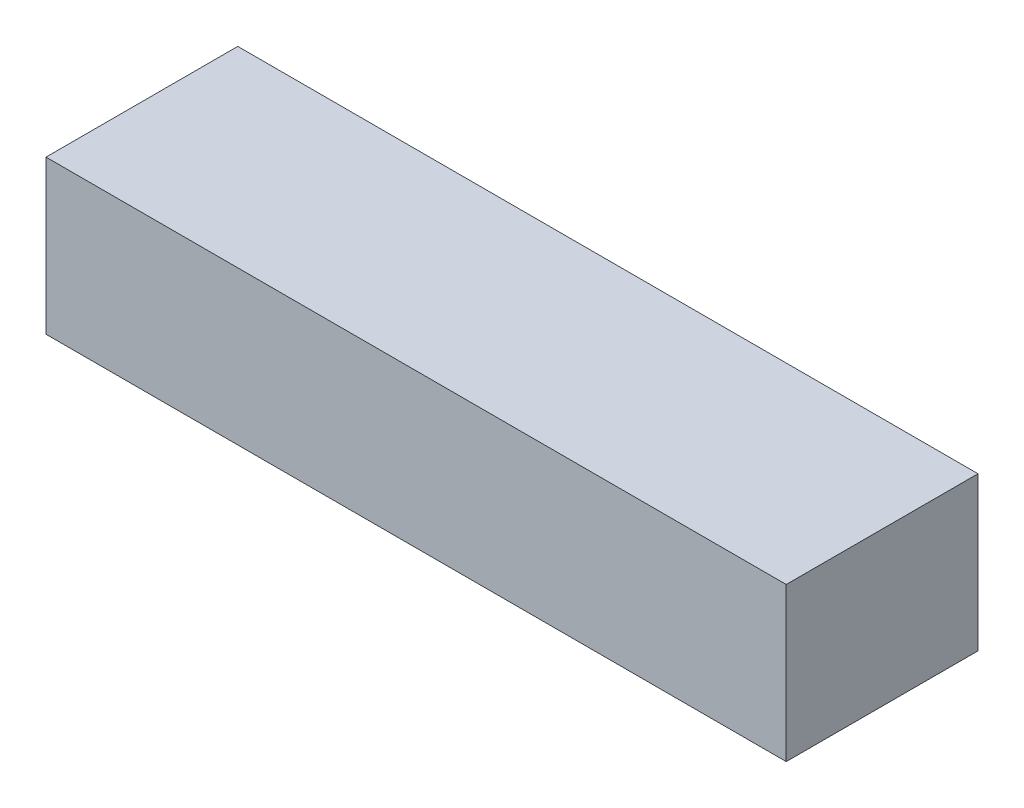
ISO-10303-21;
HEADER;
FILE_DESCRIPTION(('STEP AP214'),'2;1');
FILE_NAME('part.step','',(''),(''),'','','');
FILE_SCHEMA(('AUTOMOTIVE_DESIGN { 1 0 10303 214 1 1 1 1 }'));
ENDSEC;
DATA;
#1=APPLICATION_CONTEXT('core data for automotive mechanical design processes');
#2=APPLICATION_PROTOCOL_DEFINITION('international standard','automotive_design',2000,#1);
#3=PRODUCT_CONTEXT('',#1,'mechanical');
#4=PRODUCT('Part','Part','',(#3));
#5=PRODUCT_RELATED_PRODUCT_CATEGORY('part','',(#4));
#6=PRODUCT_DEFINITION_FORMATION('','',#4);
#7=PRODUCT_DEFINITION_CONTEXT('part definition',#1,'design');
#8=PRODUCT_DEFINITION('design','',#6,#7);
#9=PRODUCT_DEFINITION_SHAPE('','',#8);
#10=(LENGTH_UNIT() NAMED_UNIT(*) SI_UNIT(.MILLI.,.METRE.));
#11=(NAMED_UNIT(*) PLANE_ANGLE_UNIT() SI_UNIT($,.RADIAN.));
#12=(NAMED_UNIT(*) SI_UNIT($,.STERADIAN.) SOLID_ANGLE_UNIT());
#13=UNCERTAINTY_MEASURE_WITH_UNIT(LENGTH_MEASURE(1.E-05),#10,'distance_accuracy_value','');
#14=(GEOMETRIC_REPRESENTATION_CONTEXT(3) GLOBAL_UNCERTAINTY_ASSIGNED_CONTEXT((#13)) GLOBAL_UNIT_ASSIGNED_CONTEXT((#10,
#11,#12)) REPRESENTATION_CONTEXT('',''));
#15=CARTESIAN_POINT('',(0.,0.,0.));
#16=DIRECTION('',(0.,0.,1.));
#17=DIRECTION('',(1.,0.,0.));
#18=AXIS2_PLACEMENT_3D('',#15,#16,#17);
#19=CARTESIAN_POINT('',(0.,0.,0.));
#20=DIRECTION('',(0.,-1.,0.));
#21=DIRECTION('',(0.,0.,-1.));
#22=AXIS2_PLACEMENT_3D('',#19,#20,#21);
#23=PLANE('',#22);
#24=DIRECTION('',(0.,0.,-1.));
#25=VECTOR('',#24,1.);
#26=CARTESIAN_POINT('',(38.6,0.,10.));
#27=LINE('',#26,#25);
#28=CARTESIAN_POINT('',(38.6,0.,10.));
#29=VERTEX_POINT('',#28);
#30=CARTESIAN_POINT('',(38.6,0.,-10.));
#31=VERTEX_POINT('',#30);
#32=EDGE_CURVE('E331',#29,#31,#27,.T.);
#33=ORIENTED_EDGE('',*,*,#32,.F.);
#34=DIRECTION('',(1.,0.,0.));
#35=VECTOR('',#34,1.);
#36=CARTESIAN_POINT('',(-38.6,0.,10.));
#37=LINE('',#36,#35);
#38=CARTESIAN_POINT('',(-38.6,0.,10.));
#39=VERTEX_POINT('',#38);
#40=EDGE_CURVE('E337',#39,#29,#37,.T.);
#41=ORIENTED_EDGE('',*,*,#40,.F.);
#42=DIRECTION('',(0.,0.,1.));
#43=VECTOR('',#42,1.);
#44=CARTESIAN_POINT('',(-38.6,0.,10.));
#45=LINE('',#44,#43);
#46=CARTESIAN_POINT('',(-38.6,0.,-10.));
#47=VERTEX_POINT('',#46);
#48=EDGE_CURVE('E181',#47,#39,#45,.T.);
#49=ORIENTED_EDGE('',*,*,#48,.F.);
#50=DIRECTION('',(-1.,0.,0.));
#51=VECTOR('',#50,1.);
#52=CARTESIAN_POINT('',(-38.6,0.,-10.));
#53=LINE('',#52,#51);
#54=EDGE_CURVE('E334',#31,#47,#53,.T.);
#55=ORIENTED_EDGE('',*,*,#54,.F.);
#56=EDGE_LOOP('',(#33,#41,#49,#55));
#57=FACE_BOUND('',#56,.T.);
#58=DIRECTION('',(1.,0.,0.));
#59=VECTOR('',#58,1.);
#60=CARTESIAN_POINT('',(-36.6,0.,8.));
#61=LINE('',#60,#59);
#62=CARTESIAN_POINT('',(-36.6,0.,8.));
#63=VERTEX_POINT('',#62);
#64=CARTESIAN_POINT('',(-20.6,0.,8.));
#65=VERTEX_POINT('',#64);
#66=EDGE_CURVE('E302',#63,#65,#61,.T.);
#67=ORIENTED_EDGE('',*,*,#66,.T.);
#68=DIRECTION('',(0.,0.,-1.));
#69=VECTOR('',#68,1.);
#70=CARTESIAN_POINT('',(-20.6,0.,-8.));
#71=LINE('',#70,#69);
#72=CARTESIAN_POINT('',(-20.6,0.,-8.));
#73=VERTEX_POINT('',#72);
#74=EDGE_CURVE('E297',#65,#73,#71,.T.);
#75=ORIENTED_EDGE('',*,*,#74,.T.);
#76=DIRECTION('',(-1.,0.,0.));
#77=VECTOR('',#76,1.);
#78=CARTESIAN_POINT('',(-36.6,0.,-8.));
#79=LINE('',#78,#77);
#80=CARTESIAN_POINT('',(-36.6,0.,-8.));
#81=VERTEX_POINT('',#80);
#82=EDGE_CURVE('E314',#73,#81,#79,.T.);
#83=ORIENTED_EDGE('',*,*,#82,.T.);
#84=DIRECTION('',(0.,0.,1.));
#85=VECTOR('',#84,1.);
#86=CARTESIAN_POINT('',(-36.6,0.,-8.));
#87=LINE('',#86,#85);
#88=EDGE_CURVE('E317',#81,#63,#87,.T.);
#89=ORIENTED_EDGE('',*,*,#88,.T.);
#90=EDGE_LOOP('',(#67,#75,#83,#89));
#91=FACE_BOUND('',#90,.T.);
#92=DIRECTION('',(1.,0.,0.));
#93=VECTOR('',#92,1.);
#94=CARTESIAN_POINT('',(-17.6,0.,8.));
#95=LINE('',#94,#93);
#96=CARTESIAN_POINT('',(-17.6,0.,8.));
#97=VERTEX_POINT('',#96);
#98=CARTESIAN_POINT('',(-1.6,0.,8.));
#99=VERTEX_POINT('',#98);
#100=EDGE_CURVE('E268',#97,#99,#95,.T.);
#101=ORIENTED_EDGE('',*,*,#100,.T.);
#102=DIRECTION('',(0.,0.,-1.));
#103=VECTOR('',#102,1.);
#104=CARTESIAN_POINT('',(-1.6,0.,-8.));
#105=LINE('',#104,#103);
#106=CARTESIAN_POINT('',(-1.6,0.,-8.));
#107=VERTEX_POINT('',#106);
#108=EDGE_CURVE('E263',#99,#107,#105,.T.);
#109=ORIENTED_EDGE('',*,*,#108,.T.);
#110=DIRECTION('',(-1.,0.,0.));
#111=VECTOR('',#110,1.);
#112=CARTESIAN_POINT('',(-17.6,0.,-8.));
#113=LINE('',#112,#111);
#114=CARTESIAN_POINT('',(-17.6,0.,-8.));
#115=VERTEX_POINT('',#114);
#116=EDGE_CURVE('E280',#107,#115,#113,.T.);
#117=ORIENTED_EDGE('',*,*,#116,.T.);
#118=DIRECTION('',(0.,0.,1.));
#119=VECTOR('',#118,1.);
#120=CARTESIAN_POINT('',(-17.6,0.,-8.));
#121=LINE('',#120,#119);
#122=EDGE_CURVE('E283',#115,#97,#121,.T.);
#123=ORIENTED_EDGE('',*,*,#122,.T.);
#124=EDGE_LOOP('',(#101,#109,#117,#123));
#125=FACE_BOUND('',#124,.T.);
#126=DIRECTION('',(1.,0.,0.));
#127=VECTOR('',#126,1.);
#128=CARTESIAN_POINT('',(1.4,0.,8.));
#129=LINE('',#128,#127);
#130=CARTESIAN_POINT('',(1.4,0.,8.));
#131=VERTEX_POINT('',#130);
#132=CARTESIAN_POINT('',(17.4,0.,8.));
#133=VERTEX_POINT('',#132);
#134=EDGE_CURVE('E237',#131,#133,#129,.T.);
#135=ORIENTED_EDGE('',*,*,#134,.T.);
#136=DIRECTION('',(0.,0.,-1.));
#137=VECTOR('',#136,1.);
#138=CARTESIAN_POINT('',(17.4,0.,-8.));
#139=LINE('',#138,#137);
#140=CARTESIAN_POINT('',(17.4,0.,-8.));
#141=VERTEX_POINT('',#140);
#142=EDGE_CURVE('E56',#133,#141,#139,.T.);
#143=ORIENTED_EDGE('',*,*,#142,.T.);
#144=DIRECTION('',(-1.,0.,0.));
#145=VECTOR('',#144,1.);
#146=CARTESIAN_POINT('',(1.4,0.,-8.));
#147=LINE('',#146,#145);
#148=CARTESIAN_POINT('',(1.4,0.,-8.));
#149=VERTEX_POINT('',#148);
#150=EDGE_CURVE('E248',#141,#149,#147,.T.);
#151=ORIENTED_EDGE('',*,*,#150,.T.);
#152=DIRECTION('',(0.,0.,1.));
#153=VECTOR('',#152,1.);
#154=CARTESIAN_POINT('',(1.4,0.,-8.));
#155=LINE('',#154,#153);
#156=EDGE_CURVE('E251',#149,#131,#155,.T.);
#157=ORIENTED_EDGE('',*,*,#156,.T.);
#158=EDGE_LOOP('',(#135,#143,#151,#157));
#159=FACE_BOUND('',#158,.T.);
#160=DIRECTION('',(1.,0.,0.));
#161=VECTOR('',#160,1.);
#162=CARTESIAN_POINT('',(20.4,0.,8.));
#163=LINE('',#162,#161);
#164=CARTESIAN_POINT('',(20.4,0.,8.));
#165=VERTEX_POINT('',#164);
#166=CARTESIAN_POINT('',(36.4,0.,8.));
#167=VERTEX_POINT('',#166);
#168=EDGE_CURVE('E207',#165,#167,#163,.T.);
#169=ORIENTED_EDGE('',*,*,#168,.T.);
#170=DIRECTION('',(0.,0.,-1.));
#171=VECTOR('',#170,1.);
#172=CARTESIAN_POINT('',(36.4,0.,-8.));
#173=LINE('',#172,#171);
#174=CARTESIAN_POINT('',(36.4,0.,-8.));
#175=VERTEX_POINT('',#174);
#176=EDGE_CURVE('E48',#167,#175,#173,.T.);
#177=ORIENTED_EDGE('',*,*,#176,.T.);
#178=DIRECTION('',(-1.,0.,0.));
#179=VECTOR('',#178,1.);
#180=CARTESIAN_POINT('',(20.4,0.,-8.));
#181=LINE('',#180,#179);
#182=CARTESIAN_POINT('',(20.4,0.,-8.));
#183=VERTEX_POINT('',#182);
#184=EDGE_CURVE('E218',#175,#183,#181,.T.);
#185=ORIENTED_EDGE('',*,*,#184,.T.);
#186=DIRECTION('',(0.,0.,1.));
#187=VECTOR('',#186,1.);
#188=CARTESIAN_POINT('',(20.4,0.,-8.));
#189=LINE('',#188,#187);
#190=EDGE_CURVE('E221',#183,#165,#189,.T.);
#191=ORIENTED_EDGE('',*,*,#190,.T.);
#192=EDGE_LOOP('',(#169,#177,#185,#191));
#193=FACE_BOUND('',#192,.T.);
#194=ADVANCED_FACE('F33',(#57,#91,#125,#159,#193),#23,.T.);
#195=CARTESIAN_POINT('',(38.6,14.,10.));
#196=DIRECTION('',(-1.,0.,0.));
#197=DIRECTION('',(0.,0.,1.));
#198=AXIS2_PLACEMENT_3D('',#195,#196,#197);
#199=PLANE('',#198);
#200=ORIENTED_EDGE('',*,*,#32,.T.);
#201=DIRECTION('',(0.,-1.,0.));
#202=VECTOR('',#201,1.);
#203=CARTESIAN_POINT('',(38.6,14.,-10.));
#204=LINE('',#203,#202);
#205=CARTESIAN_POINT('',(38.6,16.,-10.));
#206=VERTEX_POINT('',#205);
#207=EDGE_CURVE('E11',#206,#31,#204,.T.);
#208=ORIENTED_EDGE('',*,*,#207,.F.);
#209=DIRECTION('',(0.,0.,-1.));
#210=VECTOR('',#209,1.);
#211=CARTESIAN_POINT('',(38.6,16.,-10.));
#212=LINE('',#211,#210);
#213=CARTESIAN_POINT('',(38.6,16.,10.));
#214=VERTEX_POINT('',#213);
#215=EDGE_CURVE('E193',#214,#206,#212,.T.);
#216=ORIENTED_EDGE('',*,*,#215,.F.);
#217=DIRECTION('',(0.,-1.,0.));
#218=VECTOR('',#217,1.);
#219=CARTESIAN_POINT('',(38.6,14.,10.));
#220=LINE('',#219,#218);
#221=EDGE_CURVE('E184',#214,#29,#220,.T.);
#222=ORIENTED_EDGE('',*,*,#221,.T.);
#223=EDGE_LOOP('',(#200,#208,#216,#222));
#224=FACE_BOUND('',#223,.T.);
#225=ADVANCED_FACE('F35',(#224),#199,.F.);
#226=CARTESIAN_POINT('',(-38.6,14.,-10.));
#227=DIRECTION('',(0.,0.,1.));
#228=DIRECTION('',(1.,0.,0.));
#229=AXIS2_PLACEMENT_3D('',#226,#227,#228);
#230=PLANE('',#229);
#231=ORIENTED_EDGE('',*,*,#54,.T.);
#232=DIRECTION('',(0.,-1.,0.));
#233=VECTOR('',#232,1.);
#234=CARTESIAN_POINT('',(-38.6,14.,-10.));
#235=LINE('',#234,#233);
#236=CARTESIAN_POINT('',(-38.6,16.,-10.));
#237=VERTEX_POINT('',#236);
#238=EDGE_CURVE('E41',#237,#47,#235,.T.);
#239=ORIENTED_EDGE('',*,*,#238,.F.);
#240=DIRECTION('',(-1.,0.,0.));
#241=VECTOR('',#240,1.);
#242=CARTESIAN_POINT('',(-38.6,16.,-10.));
#243=LINE('',#242,#241);
#244=EDGE_CURVE('E198',#206,#237,#243,.T.);
#245=ORIENTED_EDGE('',*,*,#244,.F.);
#246=ORIENTED_EDGE('',*,*,#207,.T.);
#247=EDGE_LOOP('',(#231,#239,#245,#246));
#248=FACE_BOUND('',#247,.T.);
#249=ADVANCED_FACE('F344',(#248),#230,.F.);
#250=CARTESIAN_POINT('',(-38.6,14.,10.));
#251=DIRECTION('',(1.,0.,0.));
#252=DIRECTION('',(0.,0.,-1.));
#253=AXIS2_PLACEMENT_3D('',#250,#251,#252);
#254=PLANE('',#253);
#255=ORIENTED_EDGE('',*,*,#48,.T.);
#256=DIRECTION('',(0.,-1.,0.));
#257=VECTOR('',#256,1.);
#258=CARTESIAN_POINT('',(-38.6,14.,10.));
#259=LINE('',#258,#257);
#260=CARTESIAN_POINT('',(-38.6,16.,10.));
#261=VERTEX_POINT('',#260);
#262=EDGE_CURVE('E174',#261,#39,#259,.T.);
#263=ORIENTED_EDGE('',*,*,#262,.F.);
#264=DIRECTION('',(0.,0.,1.));
#265=VECTOR('',#264,1.);
#266=CARTESIAN_POINT('',(-38.6,16.,-10.));
#267=LINE('',#266,#265);
#268=EDGE_CURVE('E179',#237,#261,#267,.T.);
#269=ORIENTED_EDGE('',*,*,#268,.F.);
#270=ORIENTED_EDGE('',*,*,#238,.T.);
#271=EDGE_LOOP('',(#255,#263,#269,#270));
#272=FACE_BOUND('',#271,.T.);
#273=ADVANCED_FACE('F176',(#272),#254,.F.);
#274=CARTESIAN_POINT('',(-38.6,14.,10.));
#275=DIRECTION('',(0.,0.,-1.));
#276=DIRECTION('',(-1.,0.,0.));
#277=AXIS2_PLACEMENT_3D('',#274,#275,#276);
#278=PLANE('',#277);
#279=ORIENTED_EDGE('',*,*,#40,.T.);
#280=ORIENTED_EDGE('',*,*,#221,.F.);
#281=DIRECTION('',(1.,0.,0.));
#282=VECTOR('',#281,1.);
#283=CARTESIAN_POINT('',(-38.6,16.,10.));
#284=LINE('',#283,#282);
#285=EDGE_CURVE('E187',#261,#214,#284,.T.);
#286=ORIENTED_EDGE('',*,*,#285,.F.);
#287=ORIENTED_EDGE('',*,*,#262,.T.);
#288=EDGE_LOOP('',(#279,#280,#286,#287));
#289=FACE_BOUND('',#288,.T.);
#290=ADVANCED_FACE('F188',(#289),#278,.F.);
#291=CARTESIAN_POINT('',(-20.6,14.,-8.));
#292=DIRECTION('',(-1.,0.,0.));
#293=DIRECTION('',(0.,0.,1.));
#294=AXIS2_PLACEMENT_3D('',#291,#292,#293);
#295=PLANE('',#294);
#296=ORIENTED_EDGE('',*,*,#74,.F.);
#297=DIRECTION('',(0.,-1.,0.));
#298=VECTOR('',#297,1.);
#299=CARTESIAN_POINT('',(-20.6,14.,8.));
#300=LINE('',#299,#298);
#301=CARTESIAN_POINT('',(-20.6,14.,8.));
#302=VERTEX_POINT('',#301);
#303=EDGE_CURVE('E311',#302,#65,#300,.T.);
#304=ORIENTED_EDGE('',*,*,#303,.F.);
#305=DIRECTION('',(0.,0.,-1.));
#306=VECTOR('',#305,1.);
#307=CARTESIAN_POINT('',(-20.6,14.,-8.));
#308=LINE('',#307,#306);
#309=CARTESIAN_POINT('',(-20.6,14.,-8.));
#310=VERTEX_POINT('',#309);
#311=EDGE_CURVE('E298',#302,#310,#308,.T.);
#312=ORIENTED_EDGE('',*,*,#311,.T.);
#313=DIRECTION('',(0.,-1.,0.));
#314=VECTOR('',#313,1.);
#315=CARTESIAN_POINT('',(-20.6,14.,-8.));
#316=LINE('',#315,#314);
#317=EDGE_CURVE('E328',#310,#73,#316,.T.);
#318=ORIENTED_EDGE('',*,*,#317,.T.);
#319=EDGE_LOOP('',(#296,#304,#312,#318));
#320=FACE_BOUND('',#319,.T.);
#321=ADVANCED_FACE('F357',(#320),#295,.T.);
#322=CARTESIAN_POINT('',(-36.6,14.,-8.));
#323=DIRECTION('',(0.,0.,1.));
#324=DIRECTION('',(1.,0.,0.));
#325=AXIS2_PLACEMENT_3D('',#322,#323,#324);
#326=PLANE('',#325);
#327=ORIENTED_EDGE('',*,*,#82,.F.);
#328=ORIENTED_EDGE('',*,*,#317,.F.);
#329=DIRECTION('',(-1.,0.,0.));
#330=VECTOR('',#329,1.);
#331=CARTESIAN_POINT('',(-36.6,14.,-8.));
#332=LINE('',#331,#330);
#333=CARTESIAN_POINT('',(-36.6,14.,-8.));
#334=VERTEX_POINT('',#333);
#335=EDGE_CURVE('E301',#310,#334,#332,.T.);
#336=ORIENTED_EDGE('',*,*,#335,.T.);
#337=DIRECTION('',(0.,-1.,0.));
#338=VECTOR('',#337,1.);
#339=CARTESIAN_POINT('',(-36.6,14.,-8.));
#340=LINE('',#339,#338);
#341=EDGE_CURVE('E326',#334,#81,#340,.T.);
#342=ORIENTED_EDGE('',*,*,#341,.T.);
#343=EDGE_LOOP('',(#327,#328,#336,#342));
#344=FACE_BOUND('',#343,.T.);
#345=ADVANCED_FACE('F363',(#344),#326,.T.);
#346=CARTESIAN_POINT('',(-36.6,14.,-8.));
#347=DIRECTION('',(1.,0.,0.));
#348=DIRECTION('',(0.,0.,-1.));
#349=AXIS2_PLACEMENT_3D('',#346,#347,#348);
#350=PLANE('',#349);
#351=ORIENTED_EDGE('',*,*,#88,.F.);
#352=ORIENTED_EDGE('',*,*,#341,.F.);
#353=DIRECTION('',(0.,0.,1.));
#354=VECTOR('',#353,1.);
#355=CARTESIAN_POINT('',(-36.6,14.,-8.));
#356=LINE('',#355,#354);
#357=CARTESIAN_POINT('',(-36.6,14.,8.));
#358=VERTEX_POINT('',#357);
#359=EDGE_CURVE('E305',#334,#358,#356,.T.);
#360=ORIENTED_EDGE('',*,*,#359,.T.);
#361=DIRECTION('',(0.,-1.,0.));
#362=VECTOR('',#361,1.);
#363=CARTESIAN_POINT('',(-36.6,14.,8.));
#364=LINE('',#363,#362);
#365=EDGE_CURVE('E324',#358,#63,#364,.T.);
#366=ORIENTED_EDGE('',*,*,#365,.T.);
#367=EDGE_LOOP('',(#351,#352,#360,#366));
#368=FACE_BOUND('',#367,.T.);
#369=ADVANCED_FACE('F368',(#368),#350,.T.);
#370=CARTESIAN_POINT('',(-36.6,14.,8.));
#371=DIRECTION('',(0.,0.,-1.));
#372=DIRECTION('',(-1.,0.,0.));
#373=AXIS2_PLACEMENT_3D('',#370,#371,#372);
#374=PLANE('',#373);
#375=ORIENTED_EDGE('',*,*,#66,.F.);
#376=ORIENTED_EDGE('',*,*,#365,.F.);
#377=DIRECTION('',(1.,0.,0.));
#378=VECTOR('',#377,1.);
#379=CARTESIAN_POINT('',(-36.6,14.,8.));
#380=LINE('',#379,#378);
#381=EDGE_CURVE('E308',#358,#302,#380,.T.);
#382=ORIENTED_EDGE('',*,*,#381,.T.);
#383=ORIENTED_EDGE('',*,*,#303,.T.);
#384=EDGE_LOOP('',(#375,#376,#382,#383));
#385=FACE_BOUND('',#384,.T.);
#386=ADVANCED_FACE('F374',(#385),#374,.T.);
#387=CARTESIAN_POINT('',(-1.6,14.,-8.));
#388=DIRECTION('',(-1.,0.,0.));
#389=DIRECTION('',(0.,0.,1.));
#390=AXIS2_PLACEMENT_3D('',#387,#388,#389);
#391=PLANE('',#390);
#392=ORIENTED_EDGE('',*,*,#108,.F.);
#393=DIRECTION('',(0.,-1.,0.));
#394=VECTOR('',#393,1.);
#395=CARTESIAN_POINT('',(-1.6,14.,8.));
#396=LINE('',#395,#394);
#397=CARTESIAN_POINT('',(-1.6,14.,8.));
#398=VERTEX_POINT('',#397);
#399=EDGE_CURVE('E277',#398,#99,#396,.T.);
#400=ORIENTED_EDGE('',*,*,#399,.F.);
#401=DIRECTION('',(0.,0.,-1.));
#402=VECTOR('',#401,1.);
#403=CARTESIAN_POINT('',(-1.6,14.,-8.));
#404=LINE('',#403,#402);
#405=CARTESIAN_POINT('',(-1.6,14.,-8.));
#406=VERTEX_POINT('',#405);
#407=EDGE_CURVE('E264',#398,#406,#404,.T.);
#408=ORIENTED_EDGE('',*,*,#407,.T.);
#409=DIRECTION('',(0.,-1.,0.));
#410=VECTOR('',#409,1.);
#411=CARTESIAN_POINT('',(-1.6,14.,-8.));
#412=LINE('',#411,#410);
#413=EDGE_CURVE('E294',#406,#107,#412,.T.);
#414=ORIENTED_EDGE('',*,*,#413,.T.);
#415=EDGE_LOOP('',(#392,#400,#408,#414));
#416=FACE_BOUND('',#415,.T.);
#417=ADVANCED_FACE('F444',(#416),#391,.T.);
#418=CARTESIAN_POINT('',(-17.6,14.,-8.));
#419=DIRECTION('',(0.,0.,1.));
#420=DIRECTION('',(1.,0.,0.));
#421=AXIS2_PLACEMENT_3D('',#418,#419,#420);
#422=PLANE('',#421);
#423=ORIENTED_EDGE('',*,*,#116,.F.);
#424=ORIENTED_EDGE('',*,*,#413,.F.);
#425=DIRECTION('',(-1.,0.,0.));
#426=VECTOR('',#425,1.);
#427=CARTESIAN_POINT('',(-17.6,14.,-8.));
#428=LINE('',#427,#426);
#429=CARTESIAN_POINT('',(-17.6,14.,-8.));
#430=VERTEX_POINT('',#429);
#431=EDGE_CURVE('E267',#406,#430,#428,.T.);
#432=ORIENTED_EDGE('',*,*,#431,.T.);
#433=DIRECTION('',(0.,-1.,0.));
#434=VECTOR('',#433,1.);
#435=CARTESIAN_POINT('',(-17.6,14.,-8.));
#436=LINE('',#435,#434);
#437=EDGE_CURVE('E292',#430,#115,#436,.T.);
#438=ORIENTED_EDGE('',*,*,#437,.T.);
#439=EDGE_LOOP('',(#423,#424,#432,#438));
#440=FACE_BOUND('',#439,.T.);
#441=ADVANCED_FACE('F440',(#440),#422,.T.);
#442=CARTESIAN_POINT('',(-17.6,14.,-8.));
#443=DIRECTION('',(1.,0.,0.));
#444=DIRECTION('',(0.,0.,-1.));
#445=AXIS2_PLACEMENT_3D('',#442,#443,#444);
#446=PLANE('',#445);
#447=ORIENTED_EDGE('',*,*,#122,.F.);
#448=ORIENTED_EDGE('',*,*,#437,.F.);
#449=DIRECTION('',(0.,0.,1.));
#450=VECTOR('',#449,1.);
#451=CARTESIAN_POINT('',(-17.6,14.,-8.));
#452=LINE('',#451,#450);
#453=CARTESIAN_POINT('',(-17.6,14.,8.));
#454=VERTEX_POINT('',#453);
#455=EDGE_CURVE('E271',#430,#454,#452,.T.);
#456=ORIENTED_EDGE('',*,*,#455,.T.);
#457=DIRECTION('',(0.,-1.,0.));
#458=VECTOR('',#457,1.);
#459=CARTESIAN_POINT('',(-17.6,14.,8.));
#460=LINE('',#459,#458);
#461=EDGE_CURVE('E290',#454,#97,#460,.T.);
#462=ORIENTED_EDGE('',*,*,#461,.T.);
#463=EDGE_LOOP('',(#447,#448,#456,#462));
#464=FACE_BOUND('',#463,.T.);
#465=ADVANCED_FACE('F436',(#464),#446,.T.);
#466=CARTESIAN_POINT('',(-17.6,14.,8.));
#467=DIRECTION('',(0.,0.,-1.));
#468=DIRECTION('',(-1.,0.,0.));
#469=AXIS2_PLACEMENT_3D('',#466,#467,#468);
#470=PLANE('',#469);
#471=ORIENTED_EDGE('',*,*,#100,.F.);
#472=ORIENTED_EDGE('',*,*,#461,.F.);
#473=DIRECTION('',(1.,0.,0.));
#474=VECTOR('',#473,1.);
#475=CARTESIAN_POINT('',(-17.6,14.,8.));
#476=LINE('',#475,#474);
#477=EDGE_CURVE('E274',#454,#398,#476,.T.);
#478=ORIENTED_EDGE('',*,*,#477,.T.);
#479=ORIENTED_EDGE('',*,*,#399,.T.);
#480=EDGE_LOOP('',(#471,#472,#478,#479));
#481=FACE_BOUND('',#480,.T.);
#482=ADVANCED_FACE('F433',(#481),#470,.T.);
#483=CARTESIAN_POINT('',(17.4,14.,-8.));
#484=DIRECTION('',(-1.,0.,0.));
#485=DIRECTION('',(0.,0.,1.));
#486=AXIS2_PLACEMENT_3D('',#483,#484,#485);
#487=PLANE('',#486);
#488=ORIENTED_EDGE('',*,*,#142,.F.);
#489=DIRECTION('',(0.,-1.,0.));
#490=VECTOR('',#489,1.);
#491=CARTESIAN_POINT('',(17.4,14.,8.));
#492=LINE('',#491,#490);
#493=CARTESIAN_POINT('',(17.4,14.,8.));
#494=VERTEX_POINT('',#493);
#495=EDGE_CURVE('E246',#494,#133,#492,.T.);
#496=ORIENTED_EDGE('',*,*,#495,.F.);
#497=DIRECTION('',(0.,0.,-1.));
#498=VECTOR('',#497,1.);
#499=CARTESIAN_POINT('',(17.4,14.,-8.));
#500=LINE('',#499,#498);
#501=CARTESIAN_POINT('',(17.4,14.,-8.));
#502=VERTEX_POINT('',#501);
#503=EDGE_CURVE('E233',#494,#502,#500,.T.);
#504=ORIENTED_EDGE('',*,*,#503,.T.);
#505=DIRECTION('',(0.,-1.,0.));
#506=VECTOR('',#505,1.);
#507=CARTESIAN_POINT('',(17.4,14.,-8.));
#508=LINE('',#507,#506);
#509=EDGE_CURVE('E261',#502,#141,#508,.T.);
#510=ORIENTED_EDGE('',*,*,#509,.T.);
#511=EDGE_LOOP('',(#488,#496,#504,#510));
#512=FACE_BOUND('',#511,.T.);
#513=ADVANCED_FACE('F429',(#512),#487,.T.);
#514=CARTESIAN_POINT('',(1.4,14.,-8.));
#515=DIRECTION('',(0.,0.,1.));
#516=DIRECTION('',(1.,0.,0.));
#517=AXIS2_PLACEMENT_3D('',#514,#515,#516);
#518=PLANE('',#517);
#519=ORIENTED_EDGE('',*,*,#150,.F.);
#520=ORIENTED_EDGE('',*,*,#509,.F.);
#521=DIRECTION('',(-1.,0.,0.));
#522=VECTOR('',#521,1.);
#523=CARTESIAN_POINT('',(1.4,14.,-8.));
#524=LINE('',#523,#522);
#525=CARTESIAN_POINT('',(1.4,14.,-8.));
#526=VERTEX_POINT('',#525);
#527=EDGE_CURVE('E236',#502,#526,#524,.T.);
#528=ORIENTED_EDGE('',*,*,#527,.T.);
#529=DIRECTION('',(0.,-1.,0.));
#530=VECTOR('',#529,1.);
#531=CARTESIAN_POINT('',(1.4,14.,-8.));
#532=LINE('',#531,#530);
#533=EDGE_CURVE('E259',#526,#149,#532,.T.);
#534=ORIENTED_EDGE('',*,*,#533,.T.);
#535=EDGE_LOOP('',(#519,#520,#528,#534));
#536=FACE_BOUND('',#535,.T.);
#537=ADVANCED_FACE('F425',(#536),#518,.T.);
#538=CARTESIAN_POINT('',(1.4,14.,-8.));
#539=DIRECTION('',(1.,0.,0.));
#540=DIRECTION('',(0.,0.,-1.));
#541=AXIS2_PLACEMENT_3D('',#538,#539,#540);
#542=PLANE('',#541);
#543=ORIENTED_EDGE('',*,*,#156,.F.);
#544=ORIENTED_EDGE('',*,*,#533,.F.);
#545=DIRECTION('',(0.,0.,1.));
#546=VECTOR('',#545,1.);
#547=CARTESIAN_POINT('',(1.4,14.,-8.));
#548=LINE('',#547,#546);
#549=CARTESIAN_POINT('',(1.4,14.,8.));
#550=VERTEX_POINT('',#549);
#551=EDGE_CURVE('E240',#526,#550,#548,.T.);
#552=ORIENTED_EDGE('',*,*,#551,.T.);
#553=DIRECTION('',(0.,-1.,0.));
#554=VECTOR('',#553,1.);
#555=CARTESIAN_POINT('',(1.4,14.,8.));
#556=LINE('',#555,#554);
#557=EDGE_CURVE('E257',#550,#131,#556,.T.);
#558=ORIENTED_EDGE('',*,*,#557,.T.);
#559=EDGE_LOOP('',(#543,#544,#552,#558));
#560=FACE_BOUND('',#559,.T.);
#561=ADVANCED_FACE('F418',(#560),#542,.T.);
#562=CARTESIAN_POINT('',(1.4,14.,8.));
#563=DIRECTION('',(0.,0.,-1.));
#564=DIRECTION('',(-1.,0.,0.));
#565=AXIS2_PLACEMENT_3D('',#562,#563,#564);
#566=PLANE('',#565);
#567=ORIENTED_EDGE('',*,*,#134,.F.);
#568=ORIENTED_EDGE('',*,*,#557,.F.);
#569=DIRECTION('',(1.,0.,0.));
#570=VECTOR('',#569,1.);
#571=CARTESIAN_POINT('',(1.4,14.,8.));
#572=LINE('',#571,#570);
#573=EDGE_CURVE('E243',#550,#494,#572,.T.);
#574=ORIENTED_EDGE('',*,*,#573,.T.);
#575=ORIENTED_EDGE('',*,*,#495,.T.);
#576=EDGE_LOOP('',(#567,#568,#574,#575));
#577=FACE_BOUND('',#576,.T.);
#578=ADVANCED_FACE('F410',(#577),#566,.T.);
#579=CARTESIAN_POINT('',(36.4,14.,-8.));
#580=DIRECTION('',(-1.,0.,0.));
#581=DIRECTION('',(0.,0.,1.));
#582=AXIS2_PLACEMENT_3D('',#579,#580,#581);
#583=PLANE('',#582);
#584=ORIENTED_EDGE('',*,*,#176,.F.);
#585=DIRECTION('',(0.,-1.,0.));
#586=VECTOR('',#585,1.);
#587=CARTESIAN_POINT('',(36.4,14.,8.));
#588=LINE('',#587,#586);
#589=CARTESIAN_POINT('',(36.4,14.,8.));
#590=VERTEX_POINT('',#589);
#591=EDGE_CURVE('E216',#590,#167,#588,.T.);
#592=ORIENTED_EDGE('',*,*,#591,.F.);
#593=DIRECTION('',(0.,0.,-1.));
#594=VECTOR('',#593,1.);
#595=CARTESIAN_POINT('',(36.4,14.,-8.));
#596=LINE('',#595,#594);
#597=CARTESIAN_POINT('',(36.4,14.,-8.));
#598=VERTEX_POINT('',#597);
#599=EDGE_CURVE('E203',#590,#598,#596,.T.);
#600=ORIENTED_EDGE('',*,*,#599,.T.);
#601=DIRECTION('',(0.,-1.,0.));
#602=VECTOR('',#601,1.);
#603=CARTESIAN_POINT('',(36.4,14.,-8.));
#604=LINE('',#603,#602);
#605=EDGE_CURVE('E231',#598,#175,#604,.T.);
#606=ORIENTED_EDGE('',*,*,#605,.T.);
#607=EDGE_LOOP('',(#584,#592,#600,#606));
#608=FACE_BOUND('',#607,.T.);
#609=ADVANCED_FACE('F407',(#608),#583,.T.);
#610=CARTESIAN_POINT('',(20.4,14.,-8.));
#611=DIRECTION('',(0.,0.,1.));
#612=DIRECTION('',(1.,0.,0.));
#613=AXIS2_PLACEMENT_3D('',#610,#611,#612);
#614=PLANE('',#613);
#615=ORIENTED_EDGE('',*,*,#184,.F.);
#616=ORIENTED_EDGE('',*,*,#605,.F.);
#617=DIRECTION('',(-1.,0.,0.));
#618=VECTOR('',#617,1.);
#619=CARTESIAN_POINT('',(20.4,14.,-8.));
#620=LINE('',#619,#618);
#621=CARTESIAN_POINT('',(20.4,14.,-8.));
#622=VERTEX_POINT('',#621);
#623=EDGE_CURVE('E206',#598,#622,#620,.T.);
#624=ORIENTED_EDGE('',*,*,#623,.T.);
#625=DIRECTION('',(0.,-1.,0.));
#626=VECTOR('',#625,1.);
#627=CARTESIAN_POINT('',(20.4,14.,-8.));
#628=LINE('',#627,#626);
#629=EDGE_CURVE('E229',#622,#183,#628,.T.);
#630=ORIENTED_EDGE('',*,*,#629,.T.);
#631=EDGE_LOOP('',(#615,#616,#624,#630));
#632=FACE_BOUND('',#631,.T.);
#633=ADVANCED_FACE('F409',(#632),#614,.T.);
#634=CARTESIAN_POINT('',(20.4,14.,-8.));
#635=DIRECTION('',(1.,0.,0.));
#636=DIRECTION('',(0.,0.,-1.));
#637=AXIS2_PLACEMENT_3D('',#634,#635,#636);
#638=PLANE('',#637);
#639=ORIENTED_EDGE('',*,*,#190,.F.);
#640=ORIENTED_EDGE('',*,*,#629,.F.);
#641=DIRECTION('',(0.,0.,1.));
#642=VECTOR('',#641,1.);
#643=CARTESIAN_POINT('',(20.4,14.,-8.));
#644=LINE('',#643,#642);
#645=CARTESIAN_POINT('',(20.4,14.,8.));
#646=VERTEX_POINT('',#645);
#647=EDGE_CURVE('E210',#622,#646,#644,.T.);
#648=ORIENTED_EDGE('',*,*,#647,.T.);
#649=DIRECTION('',(0.,-1.,0.));
#650=VECTOR('',#649,1.);
#651=CARTESIAN_POINT('',(20.4,14.,8.));
#652=LINE('',#651,#650);
#653=EDGE_CURVE('E227',#646,#165,#652,.T.);
#654=ORIENTED_EDGE('',*,*,#653,.T.);
#655=EDGE_LOOP('',(#639,#640,#648,#654));
#656=FACE_BOUND('',#655,.T.);
#657=ADVANCED_FACE('F402',(#656),#638,.T.);
#658=CARTESIAN_POINT('',(20.4,14.,8.));
#659=DIRECTION('',(0.,0.,-1.));
#660=DIRECTION('',(-1.,0.,0.));
#661=AXIS2_PLACEMENT_3D('',#658,#659,#660);
#662=PLANE('',#661);
#663=ORIENTED_EDGE('',*,*,#168,.F.);
#664=ORIENTED_EDGE('',*,*,#653,.F.);
#665=DIRECTION('',(1.,0.,0.));
#666=VECTOR('',#665,1.);
#667=CARTESIAN_POINT('',(20.4,14.,8.));
#668=LINE('',#667,#666);
#669=EDGE_CURVE('E213',#646,#590,#668,.T.);
#670=ORIENTED_EDGE('',*,*,#669,.T.);
#671=ORIENTED_EDGE('',*,*,#591,.T.);
#672=EDGE_LOOP('',(#663,#664,#670,#671));
#673=FACE_BOUND('',#672,.T.);
#674=ADVANCED_FACE('F395',(#673),#662,.T.);
#675=CARTESIAN_POINT('',(0.,14.,0.));
#676=DIRECTION('',(0.,1.,0.));
#677=DIRECTION('',(0.,0.,1.));
#678=AXIS2_PLACEMENT_3D('',#675,#676,#677);
#679=PLANE('',#678);
#680=ORIENTED_EDGE('',*,*,#599,.F.);
#681=ORIENTED_EDGE('',*,*,#669,.F.);
#682=ORIENTED_EDGE('',*,*,#647,.F.);
#683=ORIENTED_EDGE('',*,*,#623,.F.);
#684=EDGE_LOOP('',(#680,#681,#682,#683));
#685=FACE_BOUND('',#684,.T.);
#686=ADVANCED_FACE('F385',(#685),#679,.F.);
#687=ORIENTED_EDGE('',*,*,#503,.F.);
#688=ORIENTED_EDGE('',*,*,#573,.F.);
#689=ORIENTED_EDGE('',*,*,#551,.F.);
#690=ORIENTED_EDGE('',*,*,#527,.F.);
#691=EDGE_LOOP('',(#687,#688,#689,#690));
#692=FACE_BOUND('',#691,.T.);
#693=ADVANCED_FACE('F391',(#692),#679,.F.);
#694=ORIENTED_EDGE('',*,*,#407,.F.);
#695=ORIENTED_EDGE('',*,*,#477,.F.);
#696=ORIENTED_EDGE('',*,*,#455,.F.);
#697=ORIENTED_EDGE('',*,*,#431,.F.);
#698=EDGE_LOOP('',(#694,#695,#696,#697));
#699=FACE_BOUND('',#698,.T.);
#700=ADVANCED_FACE('F383',(#699),#679,.F.);
#701=ORIENTED_EDGE('',*,*,#311,.F.);
#702=ORIENTED_EDGE('',*,*,#381,.F.);
#703=ORIENTED_EDGE('',*,*,#359,.F.);
#704=ORIENTED_EDGE('',*,*,#335,.F.);
#705=EDGE_LOOP('',(#701,#702,#703,#704));
#706=FACE_BOUND('',#705,.T.);
#707=ADVANCED_FACE('F381',(#706),#679,.F.);
#708=CARTESIAN_POINT('',(0.,16.,0.));
#709=DIRECTION('',(0.,1.,0.));
#710=DIRECTION('',(0.,0.,1.));
#711=AXIS2_PLACEMENT_3D('',#708,#709,#710);
#712=PLANE('',#711);
#713=ORIENTED_EDGE('',*,*,#268,.T.);
#714=ORIENTED_EDGE('',*,*,#285,.T.);
#715=ORIENTED_EDGE('',*,*,#215,.T.);
#716=ORIENTED_EDGE('',*,*,#244,.T.);
#717=EDGE_LOOP('',(#713,#714,#715,#716));
#718=FACE_BOUND('',#717,.T.);
#719=ADVANCED_FACE('F196',(#718),#712,.T.);
#720=CLOSED_SHELL('',(#194,#225,#249,#273,#290,#321,#345,#369,#386,#417,#441,#465,#482,#513,
#537,#561,#578,#609,#633,#657,#674,#686,#693,#700,#707,#719));
#721=MANIFOLD_SOLID_BREP('B2',#720);
#722=ADVANCED_BREP_SHAPE_REPRESENTATION('',(#18,#721),#14);
#723=SHAPE_DEFINITION_REPRESENTATION(#9,#722);
ENDSEC;
END-ISO-10303-21;
